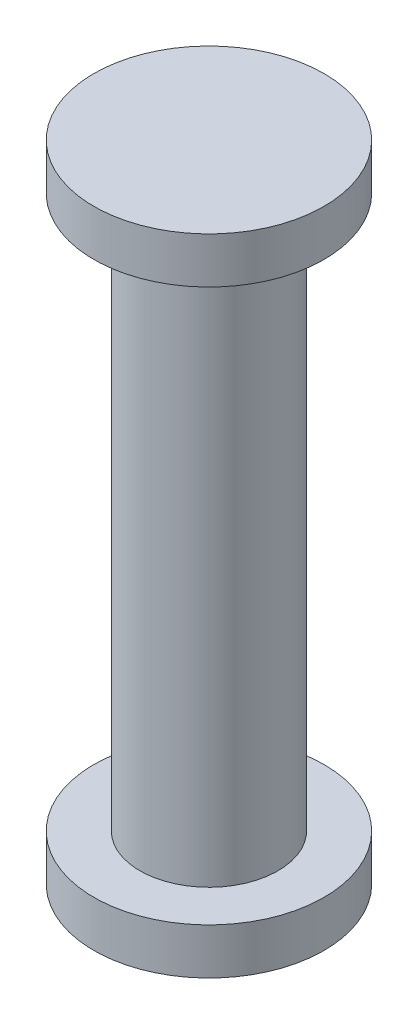
ISO-10303-21;
HEADER;
FILE_DESCRIPTION(('STEP AP214'),'2;1');
FILE_NAME('part.step','',(''),(''),'','','');
FILE_SCHEMA(('AUTOMOTIVE_DESIGN { 1 0 10303 214 1 1 1 1 }'));
ENDSEC;
DATA;
#1=APPLICATION_CONTEXT('core data for automotive mechanical design processes');
#2=APPLICATION_PROTOCOL_DEFINITION('international standard','automotive_design',2000,#1);
#3=PRODUCT_CONTEXT('',#1,'mechanical');
#4=PRODUCT('Part','Part','',(#3));
#5=PRODUCT_RELATED_PRODUCT_CATEGORY('part','',(#4));
#6=PRODUCT_DEFINITION_FORMATION('','',#4);
#7=PRODUCT_DEFINITION_CONTEXT('part definition',#1,'design');
#8=PRODUCT_DEFINITION('design','',#6,#7);
#9=PRODUCT_DEFINITION_SHAPE('','',#8);
#10=(LENGTH_UNIT() NAMED_UNIT(*) SI_UNIT(.MILLI.,.METRE.));
#11=(NAMED_UNIT(*) PLANE_ANGLE_UNIT() SI_UNIT($,.RADIAN.));
#12=(NAMED_UNIT(*) SI_UNIT($,.STERADIAN.) SOLID_ANGLE_UNIT());
#13=UNCERTAINTY_MEASURE_WITH_UNIT(LENGTH_MEASURE(1.E-05),#10,'distance_accuracy_value','');
#14=(GEOMETRIC_REPRESENTATION_CONTEXT(3) GLOBAL_UNCERTAINTY_ASSIGNED_CONTEXT((#13)) GLOBAL_UNIT_ASSIGNED_CONTEXT((#10,
#11,#12)) REPRESENTATION_CONTEXT('',''));
#15=CARTESIAN_POINT('',(0.,0.,0.));
#16=DIRECTION('',(0.,0.,1.));
#17=DIRECTION('',(1.,0.,0.));
#18=AXIS2_PLACEMENT_3D('',#15,#16,#17);
#19=CARTESIAN_POINT('',(-2.5,0.,0.));
#20=DIRECTION('',(0.,1.,0.));
#21=DIRECTION('',(0.,0.,1.));
#22=AXIS2_PLACEMENT_3D('',#19,#20,#21);
#23=PLANE('',#22);
#24=CARTESIAN_POINT('',(0.,0.,0.));
#25=DIRECTION('',(0.,-1.,0.));
#26=DIRECTION('',(0.,0.,-1.));
#27=AXIS2_PLACEMENT_3D('',#24,#25,#26);
#28=CIRCLE('',#27,2.5);
#29=CARTESIAN_POINT('',(0.,0.,-2.5));
#30=VERTEX_POINT('',#29);
#31=EDGE_CURVE('E66',#30,#30,#28,.T.);
#32=ORIENTED_EDGE('',*,*,#31,.T.);
#33=EDGE_LOOP('',(#32));
#34=FACE_BOUND('',#33,.T.);
#35=ADVANCED_FACE('F39',(#34),#23,.F.);
#36=CARTESIAN_POINT('',(0.,14.,0.));
#37=DIRECTION('',(0.,-1.,0.));
#38=DIRECTION('',(0.,0.,-1.));
#39=AXIS2_PLACEMENT_3D('',#36,#37,#38);
#40=PLANE('',#39);
#41=CARTESIAN_POINT('',(0.,14.,0.));
#42=DIRECTION('',(0.,-1.,0.));
#43=DIRECTION('',(0.,0.,-1.));
#44=AXIS2_PLACEMENT_3D('',#41,#42,#43);
#45=CIRCLE('',#44,2.5);
#46=CARTESIAN_POINT('',(0.,14.,-2.5));
#47=VERTEX_POINT('',#46);
#48=EDGE_CURVE('E10',#47,#47,#45,.T.);
#49=ORIENTED_EDGE('',*,*,#48,.F.);
#50=EDGE_LOOP('',(#49));
#51=FACE_BOUND('',#50,.T.);
#52=ADVANCED_FACE('F97',(#51),#40,.F.);
#53=CARTESIAN_POINT('',(0.,0.,0.));
#54=DIRECTION('',(0.,-1.,0.));
#55=DIRECTION('',(0.,0.,-1.));
#56=AXIS2_PLACEMENT_3D('',#53,#54,#55);
#57=CYLINDRICAL_SURFACE('',#56,2.5);
#58=CARTESIAN_POINT('',(0.,13.,0.));
#59=DIRECTION('',(0.,-1.,0.));
#60=DIRECTION('',(0.,0.,-1.));
#61=AXIS2_PLACEMENT_3D('',#58,#59,#60);
#62=CIRCLE('',#61,2.5);
#63=CARTESIAN_POINT('',(0.,13.,-2.5));
#64=VERTEX_POINT('',#63);
#65=EDGE_CURVE('E46',#64,#64,#62,.T.);
#66=ORIENTED_EDGE('',*,*,#65,.F.);
#67=EDGE_LOOP('',(#66));
#68=FACE_BOUND('',#67,.T.);
#69=ORIENTED_EDGE('',*,*,#48,.T.);
#70=EDGE_LOOP('',(#69));
#71=FACE_BOUND('',#70,.T.);
#72=ADVANCED_FACE('F92',(#68,#71),#57,.T.);
#73=CARTESIAN_POINT('',(-2.5,13.,0.));
#74=DIRECTION('',(0.,1.,0.));
#75=DIRECTION('',(0.,0.,1.));
#76=AXIS2_PLACEMENT_3D('',#73,#74,#75);
#77=PLANE('',#76);
#78=CARTESIAN_POINT('',(0.,13.,0.));
#79=DIRECTION('',(0.,-1.,0.));
#80=DIRECTION('',(0.,0.,-1.));
#81=AXIS2_PLACEMENT_3D('',#78,#79,#80);
#82=CIRCLE('',#81,1.5);
#83=CARTESIAN_POINT('',(0.,13.,-1.5));
#84=VERTEX_POINT('',#83);
#85=EDGE_CURVE('E51',#84,#84,#82,.T.);
#86=ORIENTED_EDGE('',*,*,#85,.F.);
#87=EDGE_LOOP('',(#86));
#88=FACE_BOUND('',#87,.T.);
#89=ORIENTED_EDGE('',*,*,#65,.T.);
#90=EDGE_LOOP('',(#89));
#91=FACE_BOUND('',#90,.T.);
#92=ADVANCED_FACE('F87',(#88,#91),#77,.F.);
#93=CARTESIAN_POINT('',(0.,0.,0.));
#94=DIRECTION('',(0.,-1.,0.));
#95=DIRECTION('',(0.,0.,-1.));
#96=AXIS2_PLACEMENT_3D('',#93,#94,#95);
#97=CYLINDRICAL_SURFACE('',#96,1.5);
#98=CARTESIAN_POINT('',(0.,1.,0.));
#99=DIRECTION('',(0.,-1.,0.));
#100=DIRECTION('',(0.,0.,-1.));
#101=AXIS2_PLACEMENT_3D('',#98,#99,#100);
#102=CIRCLE('',#101,1.5);
#103=CARTESIAN_POINT('',(0.,1.,-1.5));
#104=VERTEX_POINT('',#103);
#105=EDGE_CURVE('E56',#104,#104,#102,.T.);
#106=ORIENTED_EDGE('',*,*,#105,.F.);
#107=EDGE_LOOP('',(#106));
#108=FACE_BOUND('',#107,.T.);
#109=ORIENTED_EDGE('',*,*,#85,.T.);
#110=EDGE_LOOP('',(#109));
#111=FACE_BOUND('',#110,.T.);
#112=ADVANCED_FACE('F81',(#108,#111),#97,.T.);
#113=CARTESIAN_POINT('',(-1.5,1.,0.));
#114=DIRECTION('',(0.,-1.,0.));
#115=DIRECTION('',(0.,0.,-1.));
#116=AXIS2_PLACEMENT_3D('',#113,#114,#115);
#117=PLANE('',#116);
#118=CARTESIAN_POINT('',(0.,1.,0.));
#119=DIRECTION('',(0.,-1.,0.));
#120=DIRECTION('',(0.,0.,-1.));
#121=AXIS2_PLACEMENT_3D('',#118,#119,#120);
#122=CIRCLE('',#121,2.5);
#123=CARTESIAN_POINT('',(0.,1.,-2.5));
#124=VERTEX_POINT('',#123);
#125=EDGE_CURVE('E62',#124,#124,#122,.T.);
#126=ORIENTED_EDGE('',*,*,#125,.F.);
#127=EDGE_LOOP('',(#126));
#128=FACE_BOUND('',#127,.T.);
#129=ORIENTED_EDGE('',*,*,#105,.T.);
#130=EDGE_LOOP('',(#129));
#131=FACE_BOUND('',#130,.T.);
#132=ADVANCED_FACE('F75',(#128,#131),#117,.F.);
#133=CARTESIAN_POINT('',(0.,0.,0.));
#134=DIRECTION('',(0.,-1.,0.));
#135=DIRECTION('',(0.,0.,-1.));
#136=AXIS2_PLACEMENT_3D('',#133,#134,#135);
#137=CYLINDRICAL_SURFACE('',#136,2.5);
#138=ORIENTED_EDGE('',*,*,#31,.F.);
#139=EDGE_LOOP('',(#138));
#140=FACE_BOUND('',#139,.T.);
#141=ORIENTED_EDGE('',*,*,#125,.T.);
#142=EDGE_LOOP('',(#141));
#143=FACE_BOUND('',#142,.T.);
#144=ADVANCED_FACE('F72',(#140,#143),#137,.T.);
#145=CLOSED_SHELL('',(#35,#52,#72,#92,#112,#132,#144));
#146=MANIFOLD_SOLID_BREP('B2',#145);
#147=ADVANCED_BREP_SHAPE_REPRESENTATION('',(#18,#146),#14);
#148=SHAPE_DEFINITION_REPRESENTATION(#9,#147);
ENDSEC;
END-ISO-10303-21;
